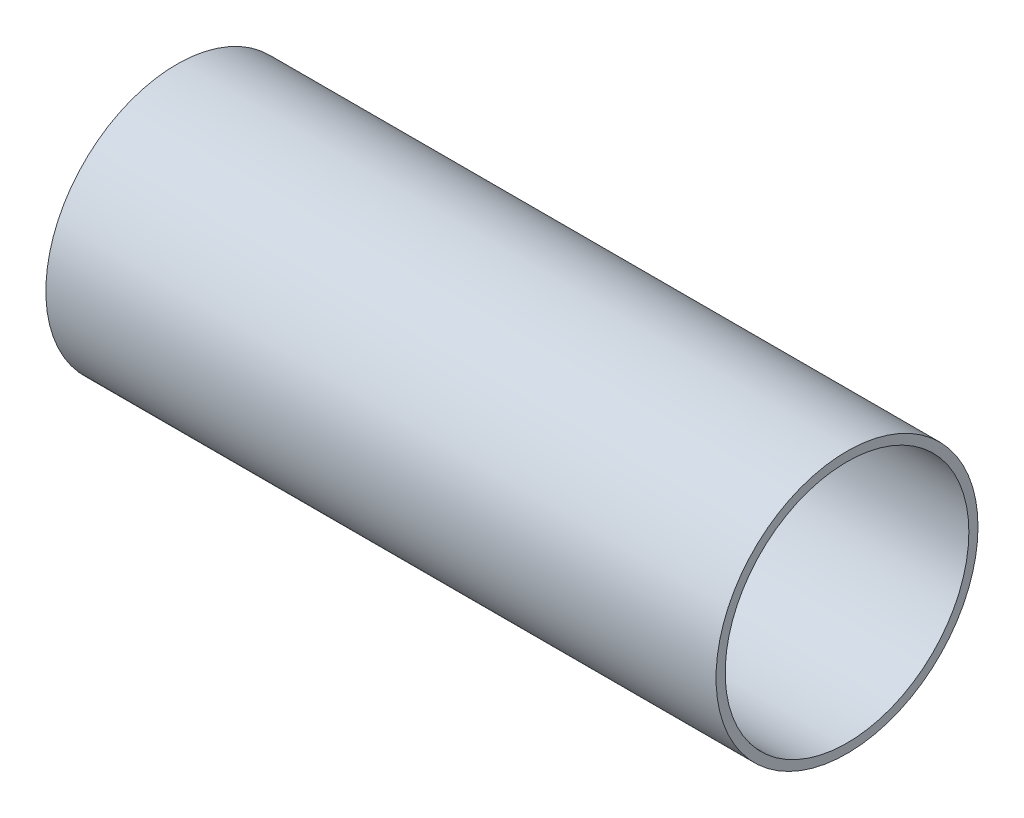
ISO-10303-21;
HEADER;
FILE_DESCRIPTION(('STEP AP214'),'2;1');
FILE_NAME('part.step','',(''),(''),'','','');
FILE_SCHEMA(('AUTOMOTIVE_DESIGN { 1 0 10303 214 1 1 1 1 }'));
ENDSEC;
DATA;
#1=APPLICATION_CONTEXT('core data for automotive mechanical design processes');
#2=APPLICATION_PROTOCOL_DEFINITION('international standard','automotive_design',2000,#1);
#3=PRODUCT_CONTEXT('',#1,'mechanical');
#4=PRODUCT('Part','Part','',(#3));
#5=PRODUCT_RELATED_PRODUCT_CATEGORY('part','',(#4));
#6=PRODUCT_DEFINITION_FORMATION('','',#4);
#7=PRODUCT_DEFINITION_CONTEXT('part definition',#1,'design');
#8=PRODUCT_DEFINITION('design','',#6,#7);
#9=PRODUCT_DEFINITION_SHAPE('','',#8);
#10=(LENGTH_UNIT() NAMED_UNIT(*) SI_UNIT(.MILLI.,.METRE.));
#11=(NAMED_UNIT(*) PLANE_ANGLE_UNIT() SI_UNIT($,.RADIAN.));
#12=(NAMED_UNIT(*) SI_UNIT($,.STERADIAN.) SOLID_ANGLE_UNIT());
#13=UNCERTAINTY_MEASURE_WITH_UNIT(LENGTH_MEASURE(1.E-05),#10,'distance_accuracy_value','');
#14=(GEOMETRIC_REPRESENTATION_CONTEXT(3) GLOBAL_UNCERTAINTY_ASSIGNED_CONTEXT((#13)) GLOBAL_UNIT_ASSIGNED_CONTEXT((#10,
#11,#12)) REPRESENTATION_CONTEXT('',''));
#15=CARTESIAN_POINT('',(0.,0.,0.));
#16=DIRECTION('',(0.,0.,1.));
#17=DIRECTION('',(1.,0.,0.));
#18=AXIS2_PLACEMENT_3D('',#15,#16,#17);
#19=CARTESIAN_POINT('',(69.85,0.,0.));
#20=DIRECTION('',(1.,0.,0.));
#21=DIRECTION('',(0.,0.,-1.));
#22=AXIS2_PLACEMENT_3D('',#19,#20,#21);
#23=PLANE('',#22);
#24=CARTESIAN_POINT('',(69.85,0.,0.));
#25=DIRECTION('',(1.,0.,0.));
#26=DIRECTION('',(0.,0.,-1.));
#27=AXIS2_PLACEMENT_3D('',#24,#25,#26);
#28=CIRCLE('',#27,27.305);
#29=CARTESIAN_POINT('',(69.85,0.,-27.305));
#30=VERTEX_POINT('',#29);
#31=EDGE_CURVE('E10',#30,#30,#28,.T.);
#32=ORIENTED_EDGE('',*,*,#31,.T.);
#33=EDGE_LOOP('',(#32));
#34=FACE_BOUND('',#33,.T.);
#35=CARTESIAN_POINT('',(69.85,0.,0.));
#36=DIRECTION('',(1.,0.,0.));
#37=DIRECTION('',(0.,0.,-1.));
#38=AXIS2_PLACEMENT_3D('',#35,#36,#37);
#39=CIRCLE('',#38,25.4);
#40=CARTESIAN_POINT('',(69.85,0.,-25.4));
#41=VERTEX_POINT('',#40);
#42=EDGE_CURVE('E54',#41,#41,#39,.T.);
#43=ORIENTED_EDGE('',*,*,#42,.F.);
#44=EDGE_LOOP('',(#43));
#45=FACE_BOUND('',#44,.T.);
#46=ADVANCED_FACE('F41',(#34,#45),#23,.T.);
#47=CARTESIAN_POINT('',(-69.85,0.,0.));
#48=DIRECTION('',(1.,0.,0.));
#49=DIRECTION('',(0.,0.,-1.));
#50=AXIS2_PLACEMENT_3D('',#47,#48,#49);
#51=PLANE('',#50);
#52=CARTESIAN_POINT('',(-69.85,0.,0.));
#53=DIRECTION('',(1.,0.,0.));
#54=DIRECTION('',(0.,0.,-1.));
#55=AXIS2_PLACEMENT_3D('',#52,#53,#54);
#56=CIRCLE('',#55,27.305);
#57=CARTESIAN_POINT('',(-69.85,0.,-27.305));
#58=VERTEX_POINT('',#57);
#59=EDGE_CURVE('E45',#58,#58,#56,.T.);
#60=ORIENTED_EDGE('',*,*,#59,.F.);
#61=EDGE_LOOP('',(#60));
#62=FACE_BOUND('',#61,.T.);
#63=CARTESIAN_POINT('',(-69.85,0.,0.));
#64=DIRECTION('',(1.,0.,0.));
#65=DIRECTION('',(0.,0.,-1.));
#66=AXIS2_PLACEMENT_3D('',#63,#64,#65);
#67=CIRCLE('',#66,25.4);
#68=CARTESIAN_POINT('',(-69.85,0.,-25.4));
#69=VERTEX_POINT('',#68);
#70=EDGE_CURVE('E56',#69,#69,#67,.T.);
#71=ORIENTED_EDGE('',*,*,#70,.T.);
#72=EDGE_LOOP('',(#71));
#73=FACE_BOUND('',#72,.T.);
#74=ADVANCED_FACE('F68',(#62,#73),#51,.F.);
#75=CARTESIAN_POINT('',(69.85,0.,0.));
#76=DIRECTION('',(-1.,0.,0.));
#77=DIRECTION('',(0.,0.,1.));
#78=AXIS2_PLACEMENT_3D('',#75,#76,#77);
#79=CYLINDRICAL_SURFACE('',#78,27.305);
#80=ORIENTED_EDGE('',*,*,#31,.F.);
#81=EDGE_LOOP('',(#80));
#82=FACE_BOUND('',#81,.T.);
#83=ORIENTED_EDGE('',*,*,#59,.T.);
#84=EDGE_LOOP('',(#83));
#85=FACE_BOUND('',#84,.T.);
#86=ADVANCED_FACE('F43',(#82,#85),#79,.T.);
#87=CARTESIAN_POINT('',(69.85,0.,0.));
#88=DIRECTION('',(-1.,0.,0.));
#89=DIRECTION('',(0.,0.,1.));
#90=AXIS2_PLACEMENT_3D('',#87,#88,#89);
#91=CYLINDRICAL_SURFACE('',#90,25.4);
#92=ORIENTED_EDGE('',*,*,#42,.T.);
#93=EDGE_LOOP('',(#92));
#94=FACE_BOUND('',#93,.T.);
#95=ORIENTED_EDGE('',*,*,#70,.F.);
#96=EDGE_LOOP('',(#95));
#97=FACE_BOUND('',#96,.T.);
#98=ADVANCED_FACE('F64',(#94,#97),#91,.F.);
#99=CLOSED_SHELL('',(#46,#74,#86,#98));
#100=MANIFOLD_SOLID_BREP('B2',#99);
#101=ADVANCED_BREP_SHAPE_REPRESENTATION('',(#18,#100),#14);
#102=SHAPE_DEFINITION_REPRESENTATION(#9,#101);
ENDSEC;
END-ISO-10303-21;
